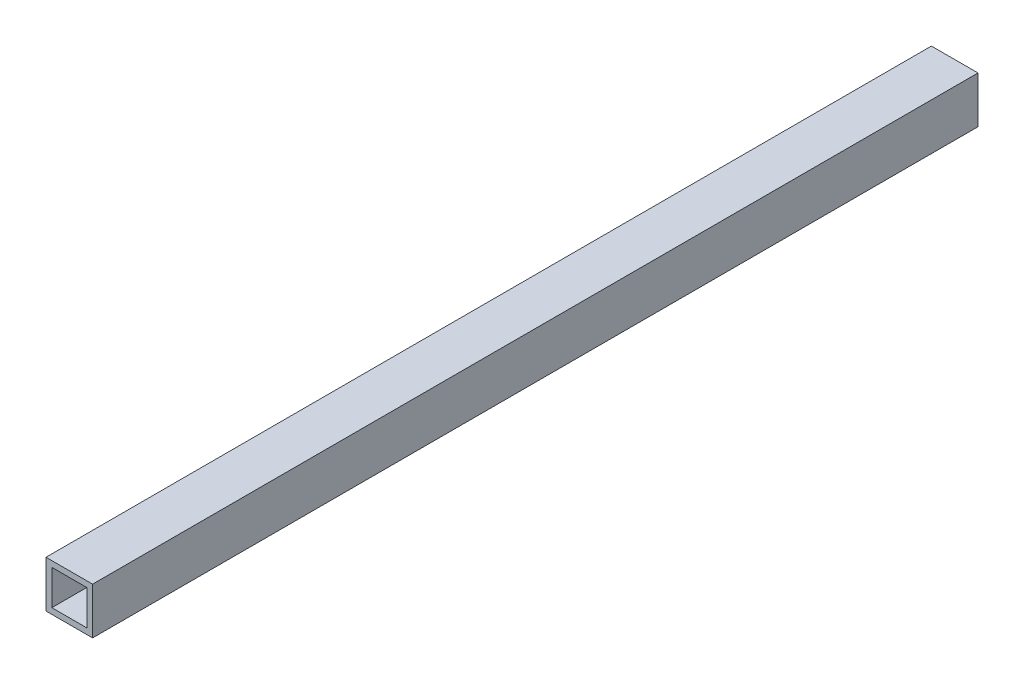
ISO-10303-21;
HEADER;
FILE_DESCRIPTION(('STEP AP214'),'2;1');
FILE_NAME('part.step','',(''),(''),'','','');
FILE_SCHEMA(('AUTOMOTIVE_DESIGN { 1 0 10303 214 1 1 1 1 }'));
ENDSEC;
DATA;
#1=APPLICATION_CONTEXT('core data for automotive mechanical design processes');
#2=APPLICATION_PROTOCOL_DEFINITION('international standard','automotive_design',2000,#1);
#3=PRODUCT_CONTEXT('',#1,'mechanical');
#4=PRODUCT('Part','Part','',(#3));
#5=PRODUCT_RELATED_PRODUCT_CATEGORY('part','',(#4));
#6=PRODUCT_DEFINITION_FORMATION('','',#4);
#7=PRODUCT_DEFINITION_CONTEXT('part definition',#1,'design');
#8=PRODUCT_DEFINITION('design','',#6,#7);
#9=PRODUCT_DEFINITION_SHAPE('','',#8);
#10=(LENGTH_UNIT() NAMED_UNIT(*) SI_UNIT(.MILLI.,.METRE.));
#11=(NAMED_UNIT(*) PLANE_ANGLE_UNIT() SI_UNIT($,.RADIAN.));
#12=(NAMED_UNIT(*) SI_UNIT($,.STERADIAN.) SOLID_ANGLE_UNIT());
#13=UNCERTAINTY_MEASURE_WITH_UNIT(LENGTH_MEASURE(1.E-05),#10,'distance_accuracy_value','');
#14=(GEOMETRIC_REPRESENTATION_CONTEXT(3) GLOBAL_UNCERTAINTY_ASSIGNED_CONTEXT((#13)) GLOBAL_UNIT_ASSIGNED_CONTEXT((#10,
#11,#12)) REPRESENTATION_CONTEXT('',''));
#15=CARTESIAN_POINT('',(0.,0.,0.));
#16=DIRECTION('',(0.,0.,1.));
#17=DIRECTION('',(1.,0.,0.));
#18=AXIS2_PLACEMENT_3D('',#15,#16,#17);
#19=CARTESIAN_POINT('',(0.,0.,482.6));
#20=DIRECTION('',(0.,0.,-1.));
#21=DIRECTION('',(-1.,0.,0.));
#22=AXIS2_PLACEMENT_3D('',#19,#20,#21);
#23=PLANE('',#22);
#24=DIRECTION('',(0.,1.,0.));
#25=VECTOR('',#24,1.);
#26=CARTESIAN_POINT('',(12.7,-12.7,482.6));
#27=LINE('',#26,#25);
#28=CARTESIAN_POINT('',(12.7,-12.7,482.6));
#29=VERTEX_POINT('',#28);
#30=CARTESIAN_POINT('',(12.7,12.7,482.6));
#31=VERTEX_POINT('',#30);
#32=EDGE_CURVE('E134',#29,#31,#27,.T.);
#33=ORIENTED_EDGE('',*,*,#32,.T.);
#34=DIRECTION('',(-1.,0.,0.));
#35=VECTOR('',#34,1.);
#36=CARTESIAN_POINT('',(-12.7,12.7,482.6));
#37=LINE('',#36,#35);
#38=CARTESIAN_POINT('',(-12.7,12.7,482.6));
#39=VERTEX_POINT('',#38);
#40=EDGE_CURVE('E137',#31,#39,#37,.T.);
#41=ORIENTED_EDGE('',*,*,#40,.T.);
#42=DIRECTION('',(0.,-1.,0.));
#43=VECTOR('',#42,1.);
#44=CARTESIAN_POINT('',(-12.7,-12.7,482.6));
#45=LINE('',#44,#43);
#46=CARTESIAN_POINT('',(-12.7,-12.7,482.6));
#47=VERTEX_POINT('',#46);
#48=EDGE_CURVE('E140',#39,#47,#45,.T.);
#49=ORIENTED_EDGE('',*,*,#48,.T.);
#50=DIRECTION('',(1.,0.,0.));
#51=VECTOR('',#50,1.);
#52=CARTESIAN_POINT('',(-12.7,-12.7,482.6));
#53=LINE('',#52,#51);
#54=EDGE_CURVE('E142',#47,#29,#53,.T.);
#55=ORIENTED_EDGE('',*,*,#54,.T.);
#56=EDGE_LOOP('',(#33,#41,#49,#55));
#57=FACE_BOUND('',#56,.T.);
#58=DIRECTION('',(0.,1.,0.));
#59=VECTOR('',#58,1.);
#60=CARTESIAN_POINT('',(9.525,-9.525,482.6));
#61=LINE('',#60,#59);
#62=CARTESIAN_POINT('',(9.525,-9.525,482.6));
#63=VERTEX_POINT('',#62);
#64=CARTESIAN_POINT('',(9.525,9.52499999999999,482.6));
#65=VERTEX_POINT('',#64);
#66=EDGE_CURVE('E98',#63,#65,#61,.T.);
#67=ORIENTED_EDGE('',*,*,#66,.F.);
#68=DIRECTION('',(1.,0.,0.));
#69=VECTOR('',#68,1.);
#70=CARTESIAN_POINT('',(-9.52499999999999,-9.525,482.6));
#71=LINE('',#70,#69);
#72=CARTESIAN_POINT('',(-9.52499999999999,-9.525,482.6));
#73=VERTEX_POINT('',#72);
#74=EDGE_CURVE('E120',#73,#63,#71,.T.);
#75=ORIENTED_EDGE('',*,*,#74,.F.);
#76=DIRECTION('',(0.,-1.,0.));
#77=VECTOR('',#76,1.);
#78=CARTESIAN_POINT('',(-9.52499999999999,-9.525,482.6));
#79=LINE('',#78,#77);
#80=CARTESIAN_POINT('',(-9.52499999999999,9.52499999999999,482.6));
#81=VERTEX_POINT('',#80);
#82=EDGE_CURVE('E118',#81,#73,#79,.T.);
#83=ORIENTED_EDGE('',*,*,#82,.F.);
#84=DIRECTION('',(-1.,0.,0.));
#85=VECTOR('',#84,1.);
#86=CARTESIAN_POINT('',(-9.52499999999999,9.52499999999999,482.6));
#87=LINE('',#86,#85);
#88=EDGE_CURVE('E106',#65,#81,#87,.T.);
#89=ORIENTED_EDGE('',*,*,#88,.F.);
#90=EDGE_LOOP('',(#67,#75,#83,#89));
#91=FACE_BOUND('',#90,.T.);
#92=ADVANCED_FACE('F33',(#57,#91),#23,.F.);
#93=CARTESIAN_POINT('',(0.,0.,0.));
#94=DIRECTION('',(0.,0.,-1.));
#95=DIRECTION('',(-1.,0.,0.));
#96=AXIS2_PLACEMENT_3D('',#93,#94,#95);
#97=PLANE('',#96);
#98=DIRECTION('',(0.,1.,0.));
#99=VECTOR('',#98,1.);
#100=CARTESIAN_POINT('',(12.7,-12.7,0.));
#101=LINE('',#100,#99);
#102=CARTESIAN_POINT('',(12.7,-12.7,0.));
#103=VERTEX_POINT('',#102);
#104=CARTESIAN_POINT('',(12.7,12.7,0.));
#105=VERTEX_POINT('',#104);
#106=EDGE_CURVE('E114',#103,#105,#101,.T.);
#107=ORIENTED_EDGE('',*,*,#106,.F.);
#108=DIRECTION('',(1.,0.,0.));
#109=VECTOR('',#108,1.);
#110=CARTESIAN_POINT('',(-12.7,-12.7,0.));
#111=LINE('',#110,#109);
#112=CARTESIAN_POINT('',(-12.7,-12.7,0.));
#113=VERTEX_POINT('',#112);
#114=EDGE_CURVE('E138',#113,#103,#111,.T.);
#115=ORIENTED_EDGE('',*,*,#114,.F.);
#116=DIRECTION('',(0.,-1.,0.));
#117=VECTOR('',#116,1.);
#118=CARTESIAN_POINT('',(-12.7,-12.7,0.));
#119=LINE('',#118,#117);
#120=CARTESIAN_POINT('',(-12.7,12.7,0.));
#121=VERTEX_POINT('',#120);
#122=EDGE_CURVE('E149',#121,#113,#119,.T.);
#123=ORIENTED_EDGE('',*,*,#122,.F.);
#124=DIRECTION('',(-1.,0.,0.));
#125=VECTOR('',#124,1.);
#126=CARTESIAN_POINT('',(-12.7,12.7,0.));
#127=LINE('',#126,#125);
#128=EDGE_CURVE('E147',#105,#121,#127,.T.);
#129=ORIENTED_EDGE('',*,*,#128,.F.);
#130=EDGE_LOOP('',(#107,#115,#123,#129));
#131=FACE_BOUND('',#130,.T.);
#132=DIRECTION('',(1.,0.,0.));
#133=VECTOR('',#132,1.);
#134=CARTESIAN_POINT('',(-9.52499999999999,-9.525,0.));
#135=LINE('',#134,#133);
#136=CARTESIAN_POINT('',(-9.52499999999999,-9.525,0.));
#137=VERTEX_POINT('',#136);
#138=CARTESIAN_POINT('',(9.525,-9.525,0.));
#139=VERTEX_POINT('',#138);
#140=EDGE_CURVE('E107',#137,#139,#135,.T.);
#141=ORIENTED_EDGE('',*,*,#140,.T.);
#142=DIRECTION('',(0.,1.,0.));
#143=VECTOR('',#142,1.);
#144=CARTESIAN_POINT('',(9.525,-9.525,0.));
#145=LINE('',#144,#143);
#146=CARTESIAN_POINT('',(9.525,9.52499999999999,0.));
#147=VERTEX_POINT('',#146);
#148=EDGE_CURVE('E56',#139,#147,#145,.T.);
#149=ORIENTED_EDGE('',*,*,#148,.T.);
#150=DIRECTION('',(-1.,0.,0.));
#151=VECTOR('',#150,1.);
#152=CARTESIAN_POINT('',(-9.52499999999999,9.52499999999999,0.));
#153=LINE('',#152,#151);
#154=CARTESIAN_POINT('',(-9.52499999999999,9.52499999999999,0.));
#155=VERTEX_POINT('',#154);
#156=EDGE_CURVE('E113',#147,#155,#153,.T.);
#157=ORIENTED_EDGE('',*,*,#156,.T.);
#158=DIRECTION('',(0.,-1.,0.));
#159=VECTOR('',#158,1.);
#160=CARTESIAN_POINT('',(-9.52499999999999,-9.525,0.));
#161=LINE('',#160,#159);
#162=EDGE_CURVE('E126',#155,#137,#161,.T.);
#163=ORIENTED_EDGE('',*,*,#162,.T.);
#164=EDGE_LOOP('',(#141,#149,#157,#163));
#165=FACE_BOUND('',#164,.T.);
#166=ADVANCED_FACE('F167',(#131,#165),#97,.T.);
#167=CARTESIAN_POINT('',(12.7,-12.7,482.6));
#168=DIRECTION('',(-1.,0.,0.));
#169=DIRECTION('',(0.,0.,1.));
#170=AXIS2_PLACEMENT_3D('',#167,#168,#169);
#171=PLANE('',#170);
#172=ORIENTED_EDGE('',*,*,#106,.T.);
#173=DIRECTION('',(0.,0.,-1.));
#174=VECTOR('',#173,1.);
#175=CARTESIAN_POINT('',(12.7,12.7,482.6));
#176=LINE('',#175,#174);
#177=EDGE_CURVE('E11',#31,#105,#176,.T.);
#178=ORIENTED_EDGE('',*,*,#177,.F.);
#179=ORIENTED_EDGE('',*,*,#32,.F.);
#180=DIRECTION('',(0.,0.,-1.));
#181=VECTOR('',#180,1.);
#182=CARTESIAN_POINT('',(12.7,-12.7,482.6));
#183=LINE('',#182,#181);
#184=EDGE_CURVE('E144',#29,#103,#183,.T.);
#185=ORIENTED_EDGE('',*,*,#184,.T.);
#186=EDGE_LOOP('',(#172,#178,#179,#185));
#187=FACE_BOUND('',#186,.T.);
#188=ADVANCED_FACE('F35',(#187),#171,.F.);
#189=CARTESIAN_POINT('',(-12.7,12.7,482.6));
#190=DIRECTION('',(0.,-1.,0.));
#191=DIRECTION('',(0.,0.,-1.));
#192=AXIS2_PLACEMENT_3D('',#189,#190,#191);
#193=PLANE('',#192);
#194=ORIENTED_EDGE('',*,*,#128,.T.);
#195=DIRECTION('',(0.,0.,-1.));
#196=VECTOR('',#195,1.);
#197=CARTESIAN_POINT('',(-12.7,12.7,482.6));
#198=LINE('',#197,#196);
#199=EDGE_CURVE('E41',#39,#121,#198,.T.);
#200=ORIENTED_EDGE('',*,*,#199,.F.);
#201=ORIENTED_EDGE('',*,*,#40,.F.);
#202=ORIENTED_EDGE('',*,*,#177,.T.);
#203=EDGE_LOOP('',(#194,#200,#201,#202));
#204=FACE_BOUND('',#203,.T.);
#205=ADVANCED_FACE('F177',(#204),#193,.F.);
#206=CARTESIAN_POINT('',(-12.7,-12.7,482.6));
#207=DIRECTION('',(1.,0.,0.));
#208=DIRECTION('',(0.,0.,-1.));
#209=AXIS2_PLACEMENT_3D('',#206,#207,#208);
#210=PLANE('',#209);
#211=ORIENTED_EDGE('',*,*,#122,.T.);
#212=DIRECTION('',(0.,0.,-1.));
#213=VECTOR('',#212,1.);
#214=CARTESIAN_POINT('',(-12.7,-12.7,482.6));
#215=LINE('',#214,#213);
#216=EDGE_CURVE('E154',#47,#113,#215,.T.);
#217=ORIENTED_EDGE('',*,*,#216,.F.);
#218=ORIENTED_EDGE('',*,*,#48,.F.);
#219=ORIENTED_EDGE('',*,*,#199,.T.);
#220=EDGE_LOOP('',(#211,#217,#218,#219));
#221=FACE_BOUND('',#220,.T.);
#222=ADVANCED_FACE('F161',(#221),#210,.F.);
#223=CARTESIAN_POINT('',(-12.7,-12.7,482.6));
#224=DIRECTION('',(0.,1.,0.));
#225=DIRECTION('',(0.,0.,1.));
#226=AXIS2_PLACEMENT_3D('',#223,#224,#225);
#227=PLANE('',#226);
#228=ORIENTED_EDGE('',*,*,#114,.T.);
#229=ORIENTED_EDGE('',*,*,#184,.F.);
#230=ORIENTED_EDGE('',*,*,#54,.F.);
#231=ORIENTED_EDGE('',*,*,#216,.T.);
#232=EDGE_LOOP('',(#228,#229,#230,#231));
#233=FACE_BOUND('',#232,.T.);
#234=ADVANCED_FACE('F171',(#233),#227,.F.);
#235=CARTESIAN_POINT('',(9.525,-9.525,482.6));
#236=DIRECTION('',(-1.,0.,0.));
#237=DIRECTION('',(0.,0.,1.));
#238=AXIS2_PLACEMENT_3D('',#235,#236,#237);
#239=PLANE('',#238);
#240=ORIENTED_EDGE('',*,*,#148,.F.);
#241=DIRECTION('',(0.,0.,-1.));
#242=VECTOR('',#241,1.);
#243=CARTESIAN_POINT('',(9.525,-9.525,482.6));
#244=LINE('',#243,#242);
#245=EDGE_CURVE('E102',#63,#139,#244,.T.);
#246=ORIENTED_EDGE('',*,*,#245,.F.);
#247=ORIENTED_EDGE('',*,*,#66,.T.);
#248=DIRECTION('',(0.,0.,-1.));
#249=VECTOR('',#248,1.);
#250=CARTESIAN_POINT('',(9.525,9.52499999999999,482.6));
#251=LINE('',#250,#249);
#252=EDGE_CURVE('E101',#65,#147,#251,.T.);
#253=ORIENTED_EDGE('',*,*,#252,.T.);
#254=EDGE_LOOP('',(#240,#246,#247,#253));
#255=FACE_BOUND('',#254,.T.);
#256=ADVANCED_FACE('F100',(#255),#239,.T.);
#257=CARTESIAN_POINT('',(-9.52499999999999,9.52499999999999,482.6));
#258=DIRECTION('',(0.,-1.,0.));
#259=DIRECTION('',(0.,0.,-1.));
#260=AXIS2_PLACEMENT_3D('',#257,#258,#259);
#261=PLANE('',#260);
#262=ORIENTED_EDGE('',*,*,#156,.F.);
#263=ORIENTED_EDGE('',*,*,#252,.F.);
#264=ORIENTED_EDGE('',*,*,#88,.T.);
#265=DIRECTION('',(0.,0.,-1.));
#266=VECTOR('',#265,1.);
#267=CARTESIAN_POINT('',(-9.52499999999999,9.52499999999999,482.6));
#268=LINE('',#267,#266);
#269=EDGE_CURVE('E115',#81,#155,#268,.T.);
#270=ORIENTED_EDGE('',*,*,#269,.T.);
#271=EDGE_LOOP('',(#262,#263,#264,#270));
#272=FACE_BOUND('',#271,.T.);
#273=ADVANCED_FACE('F110',(#272),#261,.T.);
#274=CARTESIAN_POINT('',(-9.52499999999999,-9.525,482.6));
#275=DIRECTION('',(1.,0.,0.));
#276=DIRECTION('',(0.,1.,0.));
#277=AXIS2_PLACEMENT_3D('',#274,#275,#276);
#278=PLANE('',#277);
#279=ORIENTED_EDGE('',*,*,#162,.F.);
#280=ORIENTED_EDGE('',*,*,#269,.F.);
#281=ORIENTED_EDGE('',*,*,#82,.T.);
#282=DIRECTION('',(0.,0.,-1.));
#283=VECTOR('',#282,1.);
#284=CARTESIAN_POINT('',(-9.52499999999999,-9.525,482.6));
#285=LINE('',#284,#283);
#286=EDGE_CURVE('E48',#73,#137,#285,.T.);
#287=ORIENTED_EDGE('',*,*,#286,.T.);
#288=EDGE_LOOP('',(#279,#280,#281,#287));
#289=FACE_BOUND('',#288,.T.);
#290=ADVANCED_FACE('F200',(#289),#278,.T.);
#291=CARTESIAN_POINT('',(-9.52499999999999,-9.525,482.6));
#292=DIRECTION('',(0.,1.,0.));
#293=DIRECTION('',(0.,0.,1.));
#294=AXIS2_PLACEMENT_3D('',#291,#292,#293);
#295=PLANE('',#294);
#296=ORIENTED_EDGE('',*,*,#140,.F.);
#297=ORIENTED_EDGE('',*,*,#286,.F.);
#298=ORIENTED_EDGE('',*,*,#74,.T.);
#299=ORIENTED_EDGE('',*,*,#245,.T.);
#300=EDGE_LOOP('',(#296,#297,#298,#299));
#301=FACE_BOUND('',#300,.T.);
#302=ADVANCED_FACE('F204',(#301),#295,.T.);
#303=CLOSED_SHELL('',(#92,#166,#188,#205,#222,#234,#256,#273,#290,#302));
#304=MANIFOLD_SOLID_BREP('B2',#303);
#305=ADVANCED_BREP_SHAPE_REPRESENTATION('',(#18,#304),#14);
#306=SHAPE_DEFINITION_REPRESENTATION(#9,#305);
ENDSEC;
END-ISO-10303-21;
